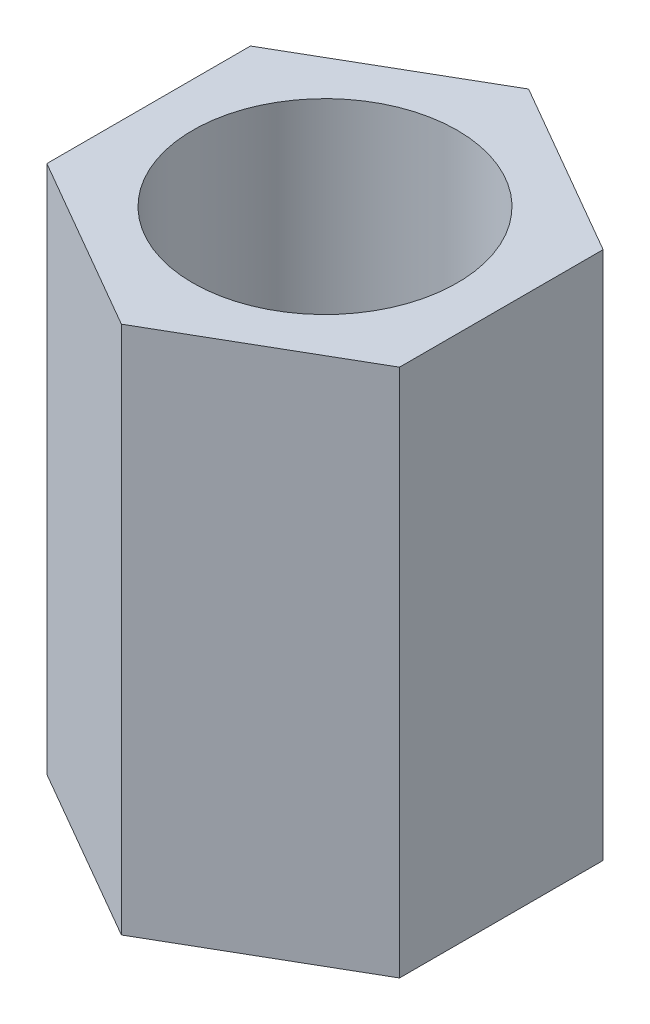
ISO-10303-21;
HEADER;
FILE_DESCRIPTION(('STEP AP214'),'2;1');
FILE_NAME('part.step','',(''),(''),'','','');
FILE_SCHEMA(('AUTOMOTIVE_DESIGN { 1 0 10303 214 1 1 1 1 }'));
ENDSEC;
DATA;
#1=APPLICATION_CONTEXT('core data for automotive mechanical design processes');
#2=APPLICATION_PROTOCOL_DEFINITION('international standard','automotive_design',2000,#1);
#3=PRODUCT_CONTEXT('',#1,'mechanical');
#4=PRODUCT('Part','Part','',(#3));
#5=PRODUCT_RELATED_PRODUCT_CATEGORY('part','',(#4));
#6=PRODUCT_DEFINITION_FORMATION('','',#4);
#7=PRODUCT_DEFINITION_CONTEXT('part definition',#1,'design');
#8=PRODUCT_DEFINITION('design','',#6,#7);
#9=PRODUCT_DEFINITION_SHAPE('','',#8);
#10=(LENGTH_UNIT() NAMED_UNIT(*) SI_UNIT(.MILLI.,.METRE.));
#11=(NAMED_UNIT(*) PLANE_ANGLE_UNIT() SI_UNIT($,.RADIAN.));
#12=(NAMED_UNIT(*) SI_UNIT($,.STERADIAN.) SOLID_ANGLE_UNIT());
#13=UNCERTAINTY_MEASURE_WITH_UNIT(LENGTH_MEASURE(1.E-05),#10,'distance_accuracy_value','');
#14=(GEOMETRIC_REPRESENTATION_CONTEXT(3) GLOBAL_UNCERTAINTY_ASSIGNED_CONTEXT((#13)) GLOBAL_UNIT_ASSIGNED_CONTEXT((#10,
#11,#12)) REPRESENTATION_CONTEXT('',''));
#15=CARTESIAN_POINT('',(0.,0.,0.));
#16=DIRECTION('',(0.,0.,1.));
#17=DIRECTION('',(1.,0.,0.));
#18=AXIS2_PLACEMENT_3D('',#15,#16,#17);
#19=CARTESIAN_POINT('',(0.,3.,0.));
#20=DIRECTION('',(0.,1.,0.));
#21=DIRECTION('',(0.,0.,1.));
#22=AXIS2_PLACEMENT_3D('',#19,#20,#21);
#23=PLANE('',#22);
#24=DIRECTION('',(0.,0.,-1.));
#25=VECTOR('',#24,1.);
#26=CARTESIAN_POINT('',(2.,3.,1.15470053837925));
#27=LINE('',#26,#25);
#28=CARTESIAN_POINT('',(2.,3.,1.15470053837925));
#29=VERTEX_POINT('',#28);
#30=CARTESIAN_POINT('',(2.,3.,-1.15470053837925));
#31=VERTEX_POINT('',#30);
#32=EDGE_CURVE('E128',#29,#31,#27,.T.);
#33=ORIENTED_EDGE('',*,*,#32,.T.);
#34=DIRECTION('',(-0.866025403784438,0.,-0.5));
#35=VECTOR('',#34,1.);
#36=CARTESIAN_POINT('',(2.,3.,-1.15470053837925));
#37=LINE('',#36,#35);
#38=CARTESIAN_POINT('',(0.,3.,-2.3094010767585));
#39=VERTEX_POINT('',#38);
#40=EDGE_CURVE('E86',#31,#39,#37,.T.);
#41=ORIENTED_EDGE('',*,*,#40,.T.);
#42=DIRECTION('',(-0.866025403784439,0.,0.5));
#43=VECTOR('',#42,1.);
#44=CARTESIAN_POINT('',(0.,3.,-2.3094010767585));
#45=LINE('',#44,#43);
#46=CARTESIAN_POINT('',(-2.,3.,-1.15470053837925));
#47=VERTEX_POINT('',#46);
#48=EDGE_CURVE('E99',#39,#47,#45,.T.);
#49=ORIENTED_EDGE('',*,*,#48,.T.);
#50=DIRECTION('',(0.,0.,1.));
#51=VECTOR('',#50,1.);
#52=CARTESIAN_POINT('',(-2.,3.,-1.15470053837925));
#53=LINE('',#52,#51);
#54=CARTESIAN_POINT('',(-2.,3.,1.15470053837925));
#55=VERTEX_POINT('',#54);
#56=EDGE_CURVE('E93',#47,#55,#53,.T.);
#57=ORIENTED_EDGE('',*,*,#56,.T.);
#58=DIRECTION('',(0.866025403784439,0.,0.5));
#59=VECTOR('',#58,1.);
#60=CARTESIAN_POINT('',(-2.,3.,1.15470053837925));
#61=LINE('',#60,#59);
#62=CARTESIAN_POINT('',(0.,3.,2.3094010767585));
#63=VERTEX_POINT('',#62);
#64=EDGE_CURVE('E97',#55,#63,#61,.T.);
#65=ORIENTED_EDGE('',*,*,#64,.T.);
#66=DIRECTION('',(0.866025403784439,0.,-0.5));
#67=VECTOR('',#66,1.);
#68=CARTESIAN_POINT('',(0.,3.,2.3094010767585));
#69=LINE('',#68,#67);
#70=EDGE_CURVE('E49',#63,#29,#69,.T.);
#71=ORIENTED_EDGE('',*,*,#70,.T.);
#72=EDGE_LOOP('',(#33,#41,#49,#57,#65,#71));
#73=FACE_BOUND('',#72,.T.);
#74=CARTESIAN_POINT('',(0.,3.,0.));
#75=DIRECTION('',(0.,1.,0.));
#76=DIRECTION('',(0.,0.,1.));
#77=AXIS2_PLACEMENT_3D('',#74,#75,#76);
#78=CIRCLE('',#77,1.5);
#79=CARTESIAN_POINT('',(0.,3.,1.5));
#80=VERTEX_POINT('',#79);
#81=EDGE_CURVE('E121',#80,#80,#78,.T.);
#82=ORIENTED_EDGE('',*,*,#81,.F.);
#83=EDGE_LOOP('',(#82));
#84=FACE_BOUND('',#83,.T.);
#85=ADVANCED_FACE('F32',(#73,#84),#23,.T.);
#86=CARTESIAN_POINT('',(0.,-3.,0.));
#87=DIRECTION('',(0.,1.,0.));
#88=DIRECTION('',(0.,0.,1.));
#89=AXIS2_PLACEMENT_3D('',#86,#87,#88);
#90=PLANE('',#89);
#91=DIRECTION('',(0.,0.,-1.));
#92=VECTOR('',#91,1.);
#93=CARTESIAN_POINT('',(2.,-3.,1.15470053837925));
#94=LINE('',#93,#92);
#95=CARTESIAN_POINT('',(2.,-3.,1.15470053837925));
#96=VERTEX_POINT('',#95);
#97=CARTESIAN_POINT('',(2.,-3.,-1.15470053837925));
#98=VERTEX_POINT('',#97);
#99=EDGE_CURVE('E117',#96,#98,#94,.T.);
#100=ORIENTED_EDGE('',*,*,#99,.F.);
#101=DIRECTION('',(0.866025403784439,0.,-0.5));
#102=VECTOR('',#101,1.);
#103=CARTESIAN_POINT('',(0.,-3.,2.3094010767585));
#104=LINE('',#103,#102);
#105=CARTESIAN_POINT('',(0.,-3.,2.3094010767585));
#106=VERTEX_POINT('',#105);
#107=EDGE_CURVE('E78',#106,#96,#104,.T.);
#108=ORIENTED_EDGE('',*,*,#107,.F.);
#109=DIRECTION('',(0.866025403784439,0.,0.5));
#110=VECTOR('',#109,1.);
#111=CARTESIAN_POINT('',(-2.,-3.,1.15470053837925));
#112=LINE('',#111,#110);
#113=CARTESIAN_POINT('',(-2.,-3.,1.15470053837925));
#114=VERTEX_POINT('',#113);
#115=EDGE_CURVE('E72',#114,#106,#112,.T.);
#116=ORIENTED_EDGE('',*,*,#115,.F.);
#117=DIRECTION('',(0.,0.,1.));
#118=VECTOR('',#117,1.);
#119=CARTESIAN_POINT('',(-2.,-3.,-1.15470053837925));
#120=LINE('',#119,#118);
#121=CARTESIAN_POINT('',(-2.,-3.,-1.15470053837925));
#122=VERTEX_POINT('',#121);
#123=EDGE_CURVE('E107',#122,#114,#120,.T.);
#124=ORIENTED_EDGE('',*,*,#123,.F.);
#125=DIRECTION('',(-0.866025403784439,0.,0.5));
#126=VECTOR('',#125,1.);
#127=CARTESIAN_POINT('',(0.,-3.,-2.3094010767585));
#128=LINE('',#127,#126);
#129=CARTESIAN_POINT('',(0.,-3.,-2.3094010767585));
#130=VERTEX_POINT('',#129);
#131=EDGE_CURVE('E123',#130,#122,#128,.T.);
#132=ORIENTED_EDGE('',*,*,#131,.F.);
#133=DIRECTION('',(-0.866025403784438,0.,-0.5));
#134=VECTOR('',#133,1.);
#135=CARTESIAN_POINT('',(2.,-3.,-1.15470053837925));
#136=LINE('',#135,#134);
#137=EDGE_CURVE('E120',#98,#130,#136,.T.);
#138=ORIENTED_EDGE('',*,*,#137,.F.);
#139=EDGE_LOOP('',(#100,#108,#116,#124,#132,#138));
#140=FACE_BOUND('',#139,.T.);
#141=CARTESIAN_POINT('',(0.,-3.,0.));
#142=DIRECTION('',(0.,1.,0.));
#143=DIRECTION('',(0.,0.,1.));
#144=AXIS2_PLACEMENT_3D('',#141,#142,#143);
#145=CIRCLE('',#144,1.5);
#146=CARTESIAN_POINT('',(0.,-3.,1.5));
#147=VERTEX_POINT('',#146);
#148=EDGE_CURVE('E221',#147,#147,#145,.T.);
#149=ORIENTED_EDGE('',*,*,#148,.T.);
#150=EDGE_LOOP('',(#149));
#151=FACE_BOUND('',#150,.T.);
#152=ADVANCED_FACE('F137',(#140,#151),#90,.F.);
#153=CARTESIAN_POINT('',(2.,3.,1.15470053837925));
#154=DIRECTION('',(-1.,0.,0.));
#155=DIRECTION('',(0.,0.,1.));
#156=AXIS2_PLACEMENT_3D('',#153,#154,#155);
#157=PLANE('',#156);
#158=ORIENTED_EDGE('',*,*,#99,.T.);
#159=DIRECTION('',(0.,-1.,0.));
#160=VECTOR('',#159,1.);
#161=CARTESIAN_POINT('',(2.,3.,-1.15470053837925));
#162=LINE('',#161,#160);
#163=EDGE_CURVE('E11',#31,#98,#162,.T.);
#164=ORIENTED_EDGE('',*,*,#163,.F.);
#165=ORIENTED_EDGE('',*,*,#32,.F.);
#166=DIRECTION('',(0.,-1.,0.));
#167=VECTOR('',#166,1.);
#168=CARTESIAN_POINT('',(2.,3.,1.15470053837925));
#169=LINE('',#168,#167);
#170=EDGE_CURVE('E113',#29,#96,#169,.T.);
#171=ORIENTED_EDGE('',*,*,#170,.T.);
#172=EDGE_LOOP('',(#158,#164,#165,#171));
#173=FACE_BOUND('',#172,.T.);
#174=ADVANCED_FACE('F34',(#173),#157,.F.);
#175=CARTESIAN_POINT('',(2.,3.,-1.15470053837925));
#176=DIRECTION('',(-0.5,0.,0.866025403784439));
#177=DIRECTION('',(0.866025403784439,0.,0.5));
#178=AXIS2_PLACEMENT_3D('',#175,#176,#177);
#179=PLANE('',#178);
#180=ORIENTED_EDGE('',*,*,#137,.T.);
#181=DIRECTION('',(0.,-1.,0.));
#182=VECTOR('',#181,1.);
#183=CARTESIAN_POINT('',(0.,3.,-2.3094010767585));
#184=LINE('',#183,#182);
#185=EDGE_CURVE('E41',#39,#130,#184,.T.);
#186=ORIENTED_EDGE('',*,*,#185,.F.);
#187=ORIENTED_EDGE('',*,*,#40,.F.);
#188=ORIENTED_EDGE('',*,*,#163,.T.);
#189=EDGE_LOOP('',(#180,#186,#187,#188));
#190=FACE_BOUND('',#189,.T.);
#191=ADVANCED_FACE('F162',(#190),#179,.F.);
#192=CARTESIAN_POINT('',(0.,3.,-2.3094010767585));
#193=DIRECTION('',(0.5,0.,0.866025403784439));
#194=DIRECTION('',(0.866025403784439,0.,-0.5));
#195=AXIS2_PLACEMENT_3D('',#192,#193,#194);
#196=PLANE('',#195);
#197=ORIENTED_EDGE('',*,*,#131,.T.);
#198=DIRECTION('',(0.,-1.,0.));
#199=VECTOR('',#198,1.);
#200=CARTESIAN_POINT('',(-2.,3.,-1.15470053837925));
#201=LINE('',#200,#199);
#202=EDGE_CURVE('E108',#47,#122,#201,.T.);
#203=ORIENTED_EDGE('',*,*,#202,.F.);
#204=ORIENTED_EDGE('',*,*,#48,.F.);
#205=ORIENTED_EDGE('',*,*,#185,.T.);
#206=EDGE_LOOP('',(#197,#203,#204,#205));
#207=FACE_BOUND('',#206,.T.);
#208=ADVANCED_FACE('F134',(#207),#196,.F.);
#209=CARTESIAN_POINT('',(-2.,3.,-1.15470053837925));
#210=DIRECTION('',(1.,0.,0.));
#211=DIRECTION('',(0.,0.,-1.));
#212=AXIS2_PLACEMENT_3D('',#209,#210,#211);
#213=PLANE('',#212);
#214=ORIENTED_EDGE('',*,*,#123,.T.);
#215=DIRECTION('',(0.,-1.,0.));
#216=VECTOR('',#215,1.);
#217=CARTESIAN_POINT('',(-2.,3.,1.15470053837925));
#218=LINE('',#217,#216);
#219=EDGE_CURVE('E104',#55,#114,#218,.T.);
#220=ORIENTED_EDGE('',*,*,#219,.F.);
#221=ORIENTED_EDGE('',*,*,#56,.F.);
#222=ORIENTED_EDGE('',*,*,#202,.T.);
#223=EDGE_LOOP('',(#214,#220,#221,#222));
#224=FACE_BOUND('',#223,.T.);
#225=ADVANCED_FACE('F105',(#224),#213,.F.);
#226=CARTESIAN_POINT('',(-2.,3.,1.15470053837925));
#227=DIRECTION('',(0.5,0.,-0.866025403784439));
#228=DIRECTION('',(-0.866025403784439,0.,-0.5));
#229=AXIS2_PLACEMENT_3D('',#226,#227,#228);
#230=PLANE('',#229);
#231=ORIENTED_EDGE('',*,*,#115,.T.);
#232=DIRECTION('',(0.,-1.,0.));
#233=VECTOR('',#232,1.);
#234=CARTESIAN_POINT('',(0.,3.,2.3094010767585));
#235=LINE('',#234,#233);
#236=EDGE_CURVE('E109',#63,#106,#235,.T.);
#237=ORIENTED_EDGE('',*,*,#236,.F.);
#238=ORIENTED_EDGE('',*,*,#64,.F.);
#239=ORIENTED_EDGE('',*,*,#219,.T.);
#240=EDGE_LOOP('',(#231,#237,#238,#239));
#241=FACE_BOUND('',#240,.T.);
#242=ADVANCED_FACE('F111',(#241),#230,.F.);
#243=CARTESIAN_POINT('',(0.,3.,2.3094010767585));
#244=DIRECTION('',(-0.5,0.,-0.866025403784439));
#245=DIRECTION('',(-0.866025403784439,0.,0.5));
#246=AXIS2_PLACEMENT_3D('',#243,#244,#245);
#247=PLANE('',#246);
#248=ORIENTED_EDGE('',*,*,#107,.T.);
#249=ORIENTED_EDGE('',*,*,#170,.F.);
#250=ORIENTED_EDGE('',*,*,#70,.F.);
#251=ORIENTED_EDGE('',*,*,#236,.T.);
#252=EDGE_LOOP('',(#248,#249,#250,#251));
#253=FACE_BOUND('',#252,.T.);
#254=ADVANCED_FACE('F142',(#253),#247,.F.);
#255=CARTESIAN_POINT('',(0.,3.,0.));
#256=DIRECTION('',(0.,-1.,0.));
#257=DIRECTION('',(0.,0.,-1.));
#258=AXIS2_PLACEMENT_3D('',#255,#256,#257);
#259=CYLINDRICAL_SURFACE('',#258,1.5);
#260=ORIENTED_EDGE('',*,*,#81,.T.);
#261=EDGE_LOOP('',(#260));
#262=FACE_BOUND('',#261,.T.);
#263=ORIENTED_EDGE('',*,*,#148,.F.);
#264=EDGE_LOOP('',(#263));
#265=FACE_BOUND('',#264,.T.);
#266=ADVANCED_FACE('F144',(#262,#265),#259,.F.);
#267=CLOSED_SHELL('',(#85,#152,#174,#191,#208,#225,#242,#254,#266));
#268=MANIFOLD_SOLID_BREP('B2',#267);
#269=ADVANCED_BREP_SHAPE_REPRESENTATION('',(#18,#268),#14);
#270=SHAPE_DEFINITION_REPRESENTATION(#9,#269);
ENDSEC;
END-ISO-10303-21;
